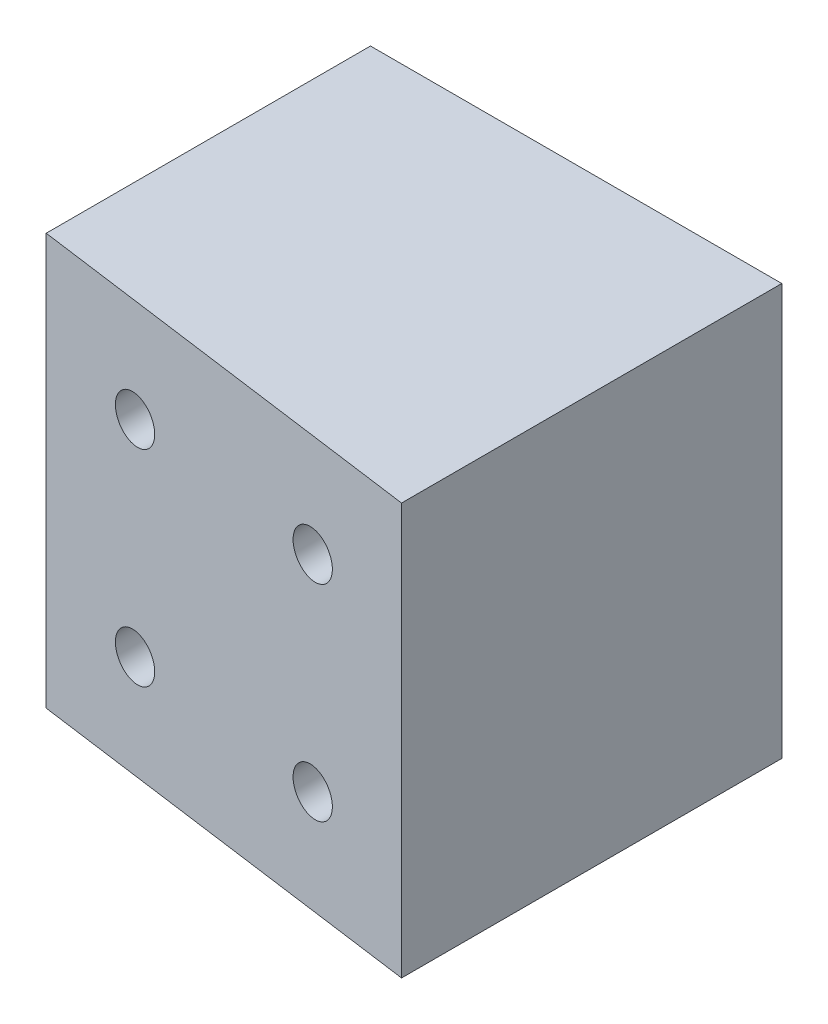
ISO-10303-21;
HEADER;
FILE_DESCRIPTION(('STEP AP214'),'2;1');
FILE_NAME('part.step','',(''),(''),'','','');
FILE_SCHEMA(('AUTOMOTIVE_DESIGN { 1 0 10303 214 1 1 1 1 }'));
ENDSEC;
DATA;
#1=APPLICATION_CONTEXT('core data for automotive mechanical design processes');
#2=APPLICATION_PROTOCOL_DEFINITION('international standard','automotive_design',2000,#1);
#3=PRODUCT_CONTEXT('',#1,'mechanical');
#4=PRODUCT('Part','Part','',(#3));
#5=PRODUCT_RELATED_PRODUCT_CATEGORY('part','',(#4));
#6=PRODUCT_DEFINITION_FORMATION('','',#4);
#7=PRODUCT_DEFINITION_CONTEXT('part definition',#1,'design');
#8=PRODUCT_DEFINITION('design','',#6,#7);
#9=PRODUCT_DEFINITION_SHAPE('','',#8);
#10=(LENGTH_UNIT() NAMED_UNIT(*) SI_UNIT(.MILLI.,.METRE.));
#11=(NAMED_UNIT(*) PLANE_ANGLE_UNIT() SI_UNIT($,.RADIAN.));
#12=(NAMED_UNIT(*) SI_UNIT($,.STERADIAN.) SOLID_ANGLE_UNIT());
#13=UNCERTAINTY_MEASURE_WITH_UNIT(LENGTH_MEASURE(1.E-05),#10,'distance_accuracy_value','');
#14=(GEOMETRIC_REPRESENTATION_CONTEXT(3) GLOBAL_UNCERTAINTY_ASSIGNED_CONTEXT((#13)) GLOBAL_UNIT_ASSIGNED_CONTEXT((#10,
#11,#12)) REPRESENTATION_CONTEXT('',''));
#15=CARTESIAN_POINT('',(0.,0.,0.));
#16=DIRECTION('',(0.,0.,1.));
#17=DIRECTION('',(1.,0.,0.));
#18=AXIS2_PLACEMENT_3D('',#15,#16,#17);
#19=CARTESIAN_POINT('',(0.,50.8,0.));
#20=DIRECTION('',(-1.,0.,0.));
#21=DIRECTION('',(0.,0.,1.));
#22=AXIS2_PLACEMENT_3D('',#19,#20,#21);
#23=PLANE('',#22);
#24=DIRECTION('',(0.,0.,-1.));
#25=VECTOR('',#24,1.);
#26=CARTESIAN_POINT('',(0.,0.,0.));
#27=LINE('',#26,#25);
#28=CARTESIAN_POINT('',(0.,0.,46.9617366227867));
#29=VERTEX_POINT('',#28);
#30=CARTESIAN_POINT('',(0.,0.,0.));
#31=VERTEX_POINT('',#30);
#32=EDGE_CURVE('E109',#29,#31,#27,.T.);
#33=ORIENTED_EDGE('',*,*,#32,.T.);
#34=DIRECTION('',(0.,-1.,0.));
#35=VECTOR('',#34,1.);
#36=CARTESIAN_POINT('',(0.,50.8,0.));
#37=LINE('',#36,#35);
#38=CARTESIAN_POINT('',(0.,50.8,0.));
#39=VERTEX_POINT('',#38);
#40=EDGE_CURVE('E11',#39,#31,#37,.T.);
#41=ORIENTED_EDGE('',*,*,#40,.F.);
#42=DIRECTION('',(0.,0.,-1.));
#43=VECTOR('',#42,1.);
#44=CARTESIAN_POINT('',(0.,50.8,0.));
#45=LINE('',#44,#43);
#46=CARTESIAN_POINT('',(0.,50.8,46.9617366227867));
#47=VERTEX_POINT('',#46);
#48=EDGE_CURVE('E96',#47,#39,#45,.T.);
#49=ORIENTED_EDGE('',*,*,#48,.F.);
#50=DIRECTION('',(0.,-1.,0.));
#51=VECTOR('',#50,1.);
#52=CARTESIAN_POINT('',(0.,50.8,46.9617366227867));
#53=LINE('',#52,#51);
#54=EDGE_CURVE('E105',#47,#29,#53,.T.);
#55=ORIENTED_EDGE('',*,*,#54,.T.);
#56=EDGE_LOOP('',(#33,#41,#49,#55));
#57=FACE_BOUND('',#56,.T.);
#58=ADVANCED_FACE('F43',(#57),#23,.F.);
#59=CARTESIAN_POINT('',(0.,50.8,0.));
#60=DIRECTION('',(0.,0.,1.));
#61=DIRECTION('',(1.,0.,0.));
#62=AXIS2_PLACEMENT_3D('',#59,#60,#61);
#63=PLANE('',#62);
#64=CARTESIAN_POINT('',(-12.6999999999999,12.7,0.));
#65=DIRECTION('',(0.,0.,1.));
#66=DIRECTION('',(0.,-1.,0.));
#67=AXIS2_PLACEMENT_3D('',#64,#65,#66);
#68=CIRCLE('',#67,2.80669999999999);
#69=CARTESIAN_POINT('',(-12.6999999999999,9.89330000000006,0.));
#70=VERTEX_POINT('',#69);
#71=EDGE_CURVE('E136',#70,#70,#68,.T.);
#72=ORIENTED_EDGE('',*,*,#71,.T.);
#73=EDGE_LOOP('',(#72));
#74=FACE_BOUND('',#73,.T.);
#75=CARTESIAN_POINT('',(-12.6999999999999,38.1000000000001,0.));
#76=DIRECTION('',(0.,0.,1.));
#77=DIRECTION('',(0.,-1.,0.));
#78=AXIS2_PLACEMENT_3D('',#75,#76,#77);
#79=CIRCLE('',#78,2.80669999999999);
#80=CARTESIAN_POINT('',(-12.6999999999999,35.2933000000001,0.));
#81=VERTEX_POINT('',#80);
#82=EDGE_CURVE('E126',#81,#81,#79,.T.);
#83=ORIENTED_EDGE('',*,*,#82,.T.);
#84=EDGE_LOOP('',(#83));
#85=FACE_BOUND('',#84,.T.);
#86=CARTESIAN_POINT('',(-38.0999999999999,12.7,2.42861286636753E-13));
#87=DIRECTION('',(0.,0.,1.));
#88=DIRECTION('',(0.,-1.,0.));
#89=AXIS2_PLACEMENT_3D('',#86,#87,#88);
#90=CIRCLE('',#89,2.80669999999999);
#91=CARTESIAN_POINT('',(-38.0999999999999,9.89329999999997,2.42861286636753E-13));
#92=VERTEX_POINT('',#91);
#93=EDGE_CURVE('E123',#92,#92,#90,.T.);
#94=ORIENTED_EDGE('',*,*,#93,.T.);
#95=EDGE_LOOP('',(#94));
#96=FACE_BOUND('',#95,.T.);
#97=CARTESIAN_POINT('',(-38.0999999999999,38.1,2.42861286636753E-13));
#98=DIRECTION('',(0.,0.,1.));
#99=DIRECTION('',(0.,-1.,0.));
#100=AXIS2_PLACEMENT_3D('',#97,#98,#99);
#101=CIRCLE('',#100,2.80669999999999);
#102=CARTESIAN_POINT('',(-38.0999999999999,35.2933,2.42861286636753E-13));
#103=VERTEX_POINT('',#102);
#104=EDGE_CURVE('E120',#103,#103,#101,.T.);
#105=ORIENTED_EDGE('',*,*,#104,.T.);
#106=EDGE_LOOP('',(#105));
#107=FACE_BOUND('',#106,.T.);
#108=DIRECTION('',(-1.,0.,0.));
#109=VECTOR('',#108,1.);
#110=CARTESIAN_POINT('',(0.,0.,0.));
#111=LINE('',#110,#109);
#112=CARTESIAN_POINT('',(-50.8,0.,0.));
#113=VERTEX_POINT('',#112);
#114=EDGE_CURVE('E100',#31,#113,#111,.T.);
#115=ORIENTED_EDGE('',*,*,#114,.T.);
#116=DIRECTION('',(0.,-1.,0.));
#117=VECTOR('',#116,1.);
#118=CARTESIAN_POINT('',(-50.8,50.8,0.));
#119=LINE('',#118,#117);
#120=CARTESIAN_POINT('',(-50.8,50.8,0.));
#121=VERTEX_POINT('',#120);
#122=EDGE_CURVE('E52',#121,#113,#119,.T.);
#123=ORIENTED_EDGE('',*,*,#122,.F.);
#124=DIRECTION('',(-1.,0.,0.));
#125=VECTOR('',#124,1.);
#126=CARTESIAN_POINT('',(0.,50.8,0.));
#127=LINE('',#126,#125);
#128=EDGE_CURVE('E91',#39,#121,#127,.T.);
#129=ORIENTED_EDGE('',*,*,#128,.F.);
#130=ORIENTED_EDGE('',*,*,#40,.T.);
#131=EDGE_LOOP('',(#115,#123,#129,#130));
#132=FACE_BOUND('',#131,.T.);
#133=ADVANCED_FACE('F99',(#74,#85,#96,#107,#132),#63,.F.);
#134=CARTESIAN_POINT('',(-50.8,50.8,0.));
#135=DIRECTION('',(1.,0.,0.));
#136=DIRECTION('',(0.,0.,-1.));
#137=AXIS2_PLACEMENT_3D('',#134,#135,#136);
#138=PLANE('',#137);
#139=DIRECTION('',(0.,0.,1.));
#140=VECTOR('',#139,1.);
#141=CARTESIAN_POINT('',(-50.8,0.,0.));
#142=LINE('',#141,#140);
#143=CARTESIAN_POINT('',(-50.8,0.,40.0463144486698));
#144=VERTEX_POINT('',#143);
#145=EDGE_CURVE('E78',#113,#144,#142,.T.);
#146=ORIENTED_EDGE('',*,*,#145,.T.);
#147=DIRECTION('',(0.,-1.,0.));
#148=VECTOR('',#147,1.);
#149=CARTESIAN_POINT('',(-50.8,50.8,40.0463144486698));
#150=LINE('',#149,#148);
#151=CARTESIAN_POINT('',(-50.8,50.8,40.0463144486698));
#152=VERTEX_POINT('',#151);
#153=EDGE_CURVE('E101',#152,#144,#150,.T.);
#154=ORIENTED_EDGE('',*,*,#153,.F.);
#155=DIRECTION('',(0.,0.,1.));
#156=VECTOR('',#155,1.);
#157=CARTESIAN_POINT('',(-50.8,50.8,0.));
#158=LINE('',#157,#156);
#159=EDGE_CURVE('E94',#121,#152,#158,.T.);
#160=ORIENTED_EDGE('',*,*,#159,.F.);
#161=ORIENTED_EDGE('',*,*,#122,.T.);
#162=EDGE_LOOP('',(#146,#154,#160,#161));
#163=FACE_BOUND('',#162,.T.);
#164=ADVANCED_FACE('F103',(#163),#138,.F.);
#165=CARTESIAN_POINT('',(-50.8,50.8,40.0463144486698));
#166=DIRECTION('',(0.134886274213767,0.,-0.990861086645716));
#167=DIRECTION('',(-0.990861086645716,0.,-0.134886274213767));
#168=AXIS2_PLACEMENT_3D('',#165,#166,#167);
#169=PLANE('',#168);
#170=CARTESIAN_POINT('',(-12.6999999999999,12.7,45.2328810792575));
#171=DIRECTION('',(0.134886274213767,0.,-0.990861086645716));
#172=DIRECTION('',(0.990861086645716,0.,0.134886274213767));
#173=AXIS2_PLACEMENT_3D('',#170,#171,#172);
#174=ELLIPSE('',#173,2.83258676501394,2.80669999999999);
#175=CARTESIAN_POINT('',(-9.89329999999989,12.7,45.6149581543774));
#176=VERTEX_POINT('',#175);
#177=EDGE_CURVE('E46',#176,#176,#174,.T.);
#178=ORIENTED_EDGE('',*,*,#177,.T.);
#179=EDGE_LOOP('',(#178));
#180=FACE_BOUND('',#179,.T.);
#181=CARTESIAN_POINT('',(-12.6999999999999,38.1000000000001,45.2328810792575));
#182=DIRECTION('',(0.134886274213767,0.,-0.990861086645716));
#183=DIRECTION('',(0.990861086645716,0.,0.134886274213767));
#184=AXIS2_PLACEMENT_3D('',#181,#182,#183);
#185=ELLIPSE('',#184,2.83258676501394,2.80669999999999);
#186=CARTESIAN_POINT('',(-9.89329999999989,38.1000000000001,45.6149581543774));
#187=VERTEX_POINT('',#186);
#188=EDGE_CURVE('E124',#187,#187,#185,.T.);
#189=ORIENTED_EDGE('',*,*,#188,.T.);
#190=EDGE_LOOP('',(#189));
#191=FACE_BOUND('',#190,.T.);
#192=CARTESIAN_POINT('',(-38.0999999999999,12.7,41.775169992199));
#193=DIRECTION('',(0.134886274213767,0.,-0.990861086645716));
#194=DIRECTION('',(0.990861086645716,0.,0.134886274213767));
#195=AXIS2_PLACEMENT_3D('',#192,#193,#194);
#196=ELLIPSE('',#195,2.83258676501394,2.80669999999999);
#197=CARTESIAN_POINT('',(-35.2932999999999,12.7,42.1572470673189));
#198=VERTEX_POINT('',#197);
#199=EDGE_CURVE('E121',#198,#198,#196,.T.);
#200=ORIENTED_EDGE('',*,*,#199,.T.);
#201=EDGE_LOOP('',(#200));
#202=FACE_BOUND('',#201,.T.);
#203=CARTESIAN_POINT('',(-38.0999999999999,38.1,41.775169992199));
#204=DIRECTION('',(0.134886274213767,0.,-0.990861086645716));
#205=DIRECTION('',(0.990861086645716,0.,0.134886274213767));
#206=AXIS2_PLACEMENT_3D('',#203,#204,#205);
#207=ELLIPSE('',#206,2.83258676501394,2.80669999999999);
#208=CARTESIAN_POINT('',(-35.2932999999999,38.1,42.1572470673189));
#209=VERTEX_POINT('',#208);
#210=EDGE_CURVE('E112',#209,#209,#207,.T.);
#211=ORIENTED_EDGE('',*,*,#210,.T.);
#212=EDGE_LOOP('',(#211));
#213=FACE_BOUND('',#212,.T.);
#214=DIRECTION('',(0.990861086645716,0.,0.134886274213767));
#215=VECTOR('',#214,1.);
#216=CARTESIAN_POINT('',(-50.8,0.,40.0463144486698));
#217=LINE('',#216,#215);
#218=EDGE_CURVE('E84',#144,#29,#217,.T.);
#219=ORIENTED_EDGE('',*,*,#218,.T.);
#220=ORIENTED_EDGE('',*,*,#54,.F.);
#221=DIRECTION('',(0.990861086645716,0.,0.134886274213767));
#222=VECTOR('',#221,1.);
#223=CARTESIAN_POINT('',(-50.8,50.8,40.0463144486698));
#224=LINE('',#223,#222);
#225=EDGE_CURVE('E61',#152,#47,#224,.T.);
#226=ORIENTED_EDGE('',*,*,#225,.F.);
#227=ORIENTED_EDGE('',*,*,#153,.T.);
#228=EDGE_LOOP('',(#219,#220,#226,#227));
#229=FACE_BOUND('',#228,.T.);
#230=ADVANCED_FACE('F151',(#180,#191,#202,#213,#229),#169,.F.);
#231=CARTESIAN_POINT('',(0.,50.8,0.));
#232=DIRECTION('',(0.,-1.,0.));
#233=DIRECTION('',(0.,0.,-1.));
#234=AXIS2_PLACEMENT_3D('',#231,#232,#233);
#235=PLANE('',#234);
#236=ORIENTED_EDGE('',*,*,#48,.T.);
#237=ORIENTED_EDGE('',*,*,#128,.T.);
#238=ORIENTED_EDGE('',*,*,#159,.T.);
#239=ORIENTED_EDGE('',*,*,#225,.T.);
#240=EDGE_LOOP('',(#236,#237,#238,#239));
#241=FACE_BOUND('',#240,.T.);
#242=ADVANCED_FACE('F92',(#241),#235,.F.);
#243=CARTESIAN_POINT('',(0.,0.,0.));
#244=DIRECTION('',(0.,-1.,0.));
#245=DIRECTION('',(0.,0.,-1.));
#246=AXIS2_PLACEMENT_3D('',#243,#244,#245);
#247=PLANE('',#246);
#248=ORIENTED_EDGE('',*,*,#32,.F.);
#249=ORIENTED_EDGE('',*,*,#218,.F.);
#250=ORIENTED_EDGE('',*,*,#145,.F.);
#251=ORIENTED_EDGE('',*,*,#114,.F.);
#252=EDGE_LOOP('',(#248,#249,#250,#251));
#253=FACE_BOUND('',#252,.T.);
#254=ADVANCED_FACE('F147',(#253),#247,.T.);
#255=CARTESIAN_POINT('',(-38.0999999999999,38.1,50.8000000000001));
#256=DIRECTION('',(0.,0.,1.));
#257=DIRECTION('',(0.,-1.,0.));
#258=AXIS2_PLACEMENT_3D('',#255,#256,#257);
#259=CYLINDRICAL_SURFACE('',#258,2.80669999999999);
#260=ORIENTED_EDGE('',*,*,#104,.F.);
#261=EDGE_LOOP('',(#260));
#262=FACE_BOUND('',#261,.T.);
#263=ORIENTED_EDGE('',*,*,#210,.F.);
#264=EDGE_LOOP('',(#263));
#265=FACE_BOUND('',#264,.T.);
#266=ADVANCED_FACE('F143',(#262,#265),#259,.F.);
#267=CARTESIAN_POINT('',(-38.0999999999999,12.7,50.8000000000001));
#268=DIRECTION('',(0.,0.,1.));
#269=DIRECTION('',(0.,-1.,0.));
#270=AXIS2_PLACEMENT_3D('',#267,#268,#269);
#271=CYLINDRICAL_SURFACE('',#270,2.80669999999999);
#272=ORIENTED_EDGE('',*,*,#93,.F.);
#273=EDGE_LOOP('',(#272));
#274=FACE_BOUND('',#273,.T.);
#275=ORIENTED_EDGE('',*,*,#199,.F.);
#276=EDGE_LOOP('',(#275));
#277=FACE_BOUND('',#276,.T.);
#278=ADVANCED_FACE('F146',(#274,#277),#271,.F.);
#279=CARTESIAN_POINT('',(-12.6999999999999,38.1000000000001,53.3400000000001));
#280=DIRECTION('',(0.,0.,1.));
#281=DIRECTION('',(0.,-1.,0.));
#282=AXIS2_PLACEMENT_3D('',#279,#280,#281);
#283=CYLINDRICAL_SURFACE('',#282,2.80669999999999);
#284=ORIENTED_EDGE('',*,*,#82,.F.);
#285=EDGE_LOOP('',(#284));
#286=FACE_BOUND('',#285,.T.);
#287=ORIENTED_EDGE('',*,*,#188,.F.);
#288=EDGE_LOOP('',(#287));
#289=FACE_BOUND('',#288,.T.);
#290=ADVANCED_FACE('F177',(#286,#289),#283,.F.);
#291=CARTESIAN_POINT('',(-12.6999999999999,12.7,53.3400000000001));
#292=DIRECTION('',(0.,0.,1.));
#293=DIRECTION('',(0.,-1.,0.));
#294=AXIS2_PLACEMENT_3D('',#291,#292,#293);
#295=CYLINDRICAL_SURFACE('',#294,2.80669999999999);
#296=ORIENTED_EDGE('',*,*,#71,.F.);
#297=EDGE_LOOP('',(#296));
#298=FACE_BOUND('',#297,.T.);
#299=ORIENTED_EDGE('',*,*,#177,.F.);
#300=EDGE_LOOP('',(#299));
#301=FACE_BOUND('',#300,.T.);
#302=ADVANCED_FACE('F180',(#298,#301),#295,.F.);
#303=CLOSED_SHELL('',(#58,#133,#164,#230,#242,#254,#266,#278,#290,#302));
#304=MANIFOLD_SOLID_BREP('B2',#303);
#305=ADVANCED_BREP_SHAPE_REPRESENTATION('',(#18,#304),#14);
#306=SHAPE_DEFINITION_REPRESENTATION(#9,#305);
ENDSEC;
END-ISO-10303-21;
